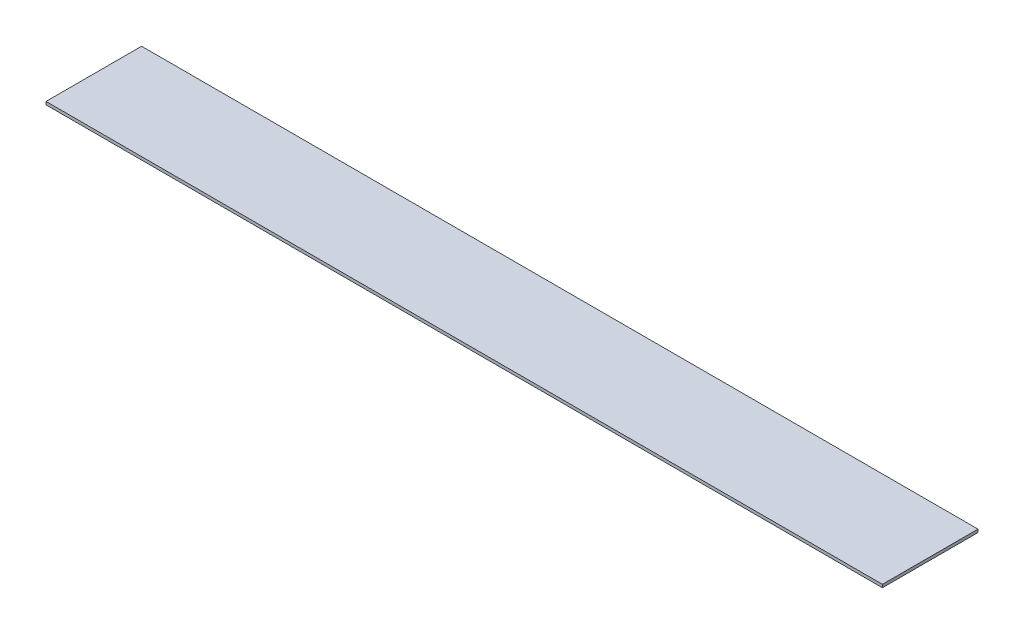
ISO-10303-21;
HEADER;
FILE_DESCRIPTION(('STEP AP214'),'2;1');
FILE_NAME('part.step','',(''),(''),'','','');
FILE_SCHEMA(('AUTOMOTIVE_DESIGN { 1 0 10303 214 1 1 1 1 }'));
ENDSEC;
DATA;
#1=APPLICATION_CONTEXT('core data for automotive mechanical design processes');
#2=APPLICATION_PROTOCOL_DEFINITION('international standard','automotive_design',2000,#1);
#3=PRODUCT_CONTEXT('',#1,'mechanical');
#4=PRODUCT('Part','Part','',(#3));
#5=PRODUCT_RELATED_PRODUCT_CATEGORY('part','',(#4));
#6=PRODUCT_DEFINITION_FORMATION('','',#4);
#7=PRODUCT_DEFINITION_CONTEXT('part definition',#1,'design');
#8=PRODUCT_DEFINITION('design','',#6,#7);
#9=PRODUCT_DEFINITION_SHAPE('','',#8);
#10=(LENGTH_UNIT() NAMED_UNIT(*) SI_UNIT(.MILLI.,.METRE.));
#11=(NAMED_UNIT(*) PLANE_ANGLE_UNIT() SI_UNIT($,.RADIAN.));
#12=(NAMED_UNIT(*) SI_UNIT($,.STERADIAN.) SOLID_ANGLE_UNIT());
#13=UNCERTAINTY_MEASURE_WITH_UNIT(LENGTH_MEASURE(1.E-05),#10,'distance_accuracy_value','');
#14=(GEOMETRIC_REPRESENTATION_CONTEXT(3) GLOBAL_UNCERTAINTY_ASSIGNED_CONTEXT((#13)) GLOBAL_UNIT_ASSIGNED_CONTEXT((#10,
#11,#12)) REPRESENTATION_CONTEXT('',''));
#15=CARTESIAN_POINT('',(0.,0.,0.));
#16=DIRECTION('',(0.,0.,1.));
#17=DIRECTION('',(1.,0.,0.));
#18=AXIS2_PLACEMENT_3D('',#15,#16,#17);
#19=CARTESIAN_POINT('',(0.,1.5875,0.));
#20=DIRECTION('',(1.,0.,0.));
#21=DIRECTION('',(0.,0.,-1.));
#22=AXIS2_PLACEMENT_3D('',#19,#20,#21);
#23=PLANE('',#22);
#24=DIRECTION('',(0.,0.,1.));
#25=VECTOR('',#24,1.);
#26=CARTESIAN_POINT('',(0.,0.,0.));
#27=LINE('',#26,#25);
#28=CARTESIAN_POINT('',(0.,0.,-50.8));
#29=VERTEX_POINT('',#28);
#30=CARTESIAN_POINT('',(0.,0.,0.));
#31=VERTEX_POINT('',#30);
#32=EDGE_CURVE('E95',#29,#31,#27,.T.);
#33=ORIENTED_EDGE('',*,*,#32,.T.);
#34=DIRECTION('',(0.,-1.,0.));
#35=VECTOR('',#34,1.);
#36=CARTESIAN_POINT('',(0.,1.5875,0.));
#37=LINE('',#36,#35);
#38=CARTESIAN_POINT('',(0.,1.5875,0.));
#39=VERTEX_POINT('',#38);
#40=EDGE_CURVE('E11',#39,#31,#37,.T.);
#41=ORIENTED_EDGE('',*,*,#40,.F.);
#42=DIRECTION('',(0.,0.,1.));
#43=VECTOR('',#42,1.);
#44=CARTESIAN_POINT('',(0.,1.5875,0.));
#45=LINE('',#44,#43);
#46=CARTESIAN_POINT('',(0.,1.5875,-50.8));
#47=VERTEX_POINT('',#46);
#48=EDGE_CURVE('E83',#47,#39,#45,.T.);
#49=ORIENTED_EDGE('',*,*,#48,.F.);
#50=DIRECTION('',(0.,-1.,0.));
#51=VECTOR('',#50,1.);
#52=CARTESIAN_POINT('',(0.,1.5875,-50.8));
#53=LINE('',#52,#51);
#54=EDGE_CURVE('E91',#47,#29,#53,.T.);
#55=ORIENTED_EDGE('',*,*,#54,.T.);
#56=EDGE_LOOP('',(#33,#41,#49,#55));
#57=FACE_BOUND('',#56,.T.);
#58=ADVANCED_FACE('F32',(#57),#23,.F.);
#59=CARTESIAN_POINT('',(0.,1.5875,0.));
#60=DIRECTION('',(0.,0.,-1.));
#61=DIRECTION('',(-1.,0.,0.));
#62=AXIS2_PLACEMENT_3D('',#59,#60,#61);
#63=PLANE('',#62);
#64=DIRECTION('',(1.,0.,0.));
#65=VECTOR('',#64,1.);
#66=CARTESIAN_POINT('',(0.,0.,0.));
#67=LINE('',#66,#65);
#68=CARTESIAN_POINT('',(444.5,0.,0.));
#69=VERTEX_POINT('',#68);
#70=EDGE_CURVE('E87',#31,#69,#67,.T.);
#71=ORIENTED_EDGE('',*,*,#70,.T.);
#72=DIRECTION('',(0.,-1.,0.));
#73=VECTOR('',#72,1.);
#74=CARTESIAN_POINT('',(444.5,1.5875,0.));
#75=LINE('',#74,#73);
#76=CARTESIAN_POINT('',(444.5,1.5875,0.));
#77=VERTEX_POINT('',#76);
#78=EDGE_CURVE('E40',#77,#69,#75,.T.);
#79=ORIENTED_EDGE('',*,*,#78,.F.);
#80=DIRECTION('',(1.,0.,0.));
#81=VECTOR('',#80,1.);
#82=CARTESIAN_POINT('',(0.,1.5875,0.));
#83=LINE('',#82,#81);
#84=EDGE_CURVE('E78',#39,#77,#83,.T.);
#85=ORIENTED_EDGE('',*,*,#84,.F.);
#86=ORIENTED_EDGE('',*,*,#40,.T.);
#87=EDGE_LOOP('',(#71,#79,#85,#86));
#88=FACE_BOUND('',#87,.T.);
#89=ADVANCED_FACE('F86',(#88),#63,.F.);
#90=CARTESIAN_POINT('',(444.5,1.5875,0.));
#91=DIRECTION('',(-1.,0.,0.));
#92=DIRECTION('',(0.,0.,1.));
#93=AXIS2_PLACEMENT_3D('',#90,#91,#92);
#94=PLANE('',#93);
#95=DIRECTION('',(0.,0.,-1.));
#96=VECTOR('',#95,1.);
#97=CARTESIAN_POINT('',(444.5,0.,0.));
#98=LINE('',#97,#96);
#99=CARTESIAN_POINT('',(444.5,0.,-50.8));
#100=VERTEX_POINT('',#99);
#101=EDGE_CURVE('E65',#69,#100,#98,.T.);
#102=ORIENTED_EDGE('',*,*,#101,.T.);
#103=DIRECTION('',(0.,-1.,0.));
#104=VECTOR('',#103,1.);
#105=CARTESIAN_POINT('',(444.5,1.5875,-50.8));
#106=LINE('',#105,#104);
#107=CARTESIAN_POINT('',(444.5,1.5875,-50.8));
#108=VERTEX_POINT('',#107);
#109=EDGE_CURVE('E88',#108,#100,#106,.T.);
#110=ORIENTED_EDGE('',*,*,#109,.F.);
#111=DIRECTION('',(0.,0.,-1.));
#112=VECTOR('',#111,1.);
#113=CARTESIAN_POINT('',(444.5,1.5875,0.));
#114=LINE('',#113,#112);
#115=EDGE_CURVE('E81',#77,#108,#114,.T.);
#116=ORIENTED_EDGE('',*,*,#115,.F.);
#117=ORIENTED_EDGE('',*,*,#78,.T.);
#118=EDGE_LOOP('',(#102,#110,#116,#117));
#119=FACE_BOUND('',#118,.T.);
#120=ADVANCED_FACE('F89',(#119),#94,.F.);
#121=CARTESIAN_POINT('',(0.,1.5875,-50.8));
#122=DIRECTION('',(0.,0.,1.));
#123=DIRECTION('',(1.,0.,0.));
#124=AXIS2_PLACEMENT_3D('',#121,#122,#123);
#125=PLANE('',#124);
#126=DIRECTION('',(-1.,0.,0.));
#127=VECTOR('',#126,1.);
#128=CARTESIAN_POINT('',(0.,0.,-50.8));
#129=LINE('',#128,#127);
#130=EDGE_CURVE('E71',#100,#29,#129,.T.);
#131=ORIENTED_EDGE('',*,*,#130,.T.);
#132=ORIENTED_EDGE('',*,*,#54,.F.);
#133=DIRECTION('',(-1.,0.,0.));
#134=VECTOR('',#133,1.);
#135=CARTESIAN_POINT('',(0.,1.5875,-50.8));
#136=LINE('',#135,#134);
#137=EDGE_CURVE('E48',#108,#47,#136,.T.);
#138=ORIENTED_EDGE('',*,*,#137,.F.);
#139=ORIENTED_EDGE('',*,*,#109,.T.);
#140=EDGE_LOOP('',(#131,#132,#138,#139));
#141=FACE_BOUND('',#140,.T.);
#142=ADVANCED_FACE('F102',(#141),#125,.F.);
#143=CARTESIAN_POINT('',(0.,1.5875,0.));
#144=DIRECTION('',(0.,-1.,0.));
#145=DIRECTION('',(0.,0.,-1.));
#146=AXIS2_PLACEMENT_3D('',#143,#144,#145);
#147=PLANE('',#146);
#148=ORIENTED_EDGE('',*,*,#48,.T.);
#149=ORIENTED_EDGE('',*,*,#84,.T.);
#150=ORIENTED_EDGE('',*,*,#115,.T.);
#151=ORIENTED_EDGE('',*,*,#137,.T.);
#152=EDGE_LOOP('',(#148,#149,#150,#151));
#153=FACE_BOUND('',#152,.T.);
#154=ADVANCED_FACE('F79',(#153),#147,.F.);
#155=CARTESIAN_POINT('',(0.,0.,0.));
#156=DIRECTION('',(0.,-1.,0.));
#157=DIRECTION('',(0.,0.,-1.));
#158=AXIS2_PLACEMENT_3D('',#155,#156,#157);
#159=PLANE('',#158);
#160=ORIENTED_EDGE('',*,*,#32,.F.);
#161=ORIENTED_EDGE('',*,*,#130,.F.);
#162=ORIENTED_EDGE('',*,*,#101,.F.);
#163=ORIENTED_EDGE('',*,*,#70,.F.);
#164=EDGE_LOOP('',(#160,#161,#162,#163));
#165=FACE_BOUND('',#164,.T.);
#166=ADVANCED_FACE('F105',(#165),#159,.T.);
#167=CLOSED_SHELL('',(#58,#89,#120,#142,#154,#166));
#168=MANIFOLD_SOLID_BREP('B2',#167);
#169=ADVANCED_BREP_SHAPE_REPRESENTATION('',(#18,#168),#14);
#170=SHAPE_DEFINITION_REPRESENTATION(#9,#169);
ENDSEC;
END-ISO-10303-21;
